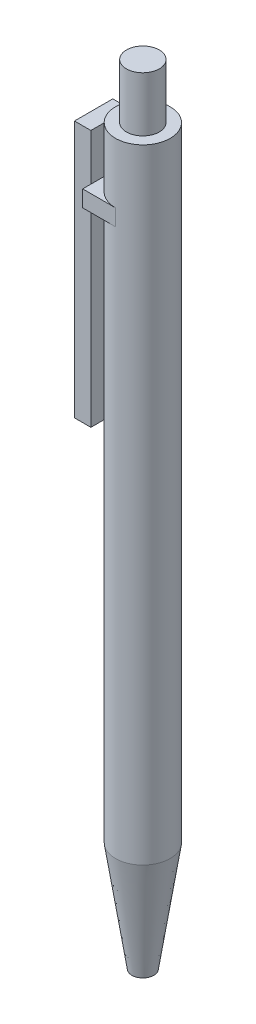
ISO-10303-21;
HEADER;
FILE_DESCRIPTION(('STEP AP214'),'2;1');
FILE_NAME('part.step','',(''),(''),'','','');
FILE_SCHEMA(('AUTOMOTIVE_DESIGN { 1 0 10303 214 1 1 1 1 }'));
ENDSEC;
DATA;
#1=APPLICATION_CONTEXT('core data for automotive mechanical design processes');
#2=APPLICATION_PROTOCOL_DEFINITION('international standard','automotive_design',2000,#1);
#3=PRODUCT_CONTEXT('',#1,'mechanical');
#4=PRODUCT('Part','Part','',(#3));
#5=PRODUCT_RELATED_PRODUCT_CATEGORY('part','',(#4));
#6=PRODUCT_DEFINITION_FORMATION('','',#4);
#7=PRODUCT_DEFINITION_CONTEXT('part definition',#1,'design');
#8=PRODUCT_DEFINITION('design','',#6,#7);
#9=PRODUCT_DEFINITION_SHAPE('','',#8);
#10=(LENGTH_UNIT() NAMED_UNIT(*) SI_UNIT(.MILLI.,.METRE.));
#11=(NAMED_UNIT(*) PLANE_ANGLE_UNIT() SI_UNIT($,.RADIAN.));
#12=(NAMED_UNIT(*) SI_UNIT($,.STERADIAN.) SOLID_ANGLE_UNIT());
#13=UNCERTAINTY_MEASURE_WITH_UNIT(LENGTH_MEASURE(1.E-05),#10,'distance_accuracy_value','');
#14=(GEOMETRIC_REPRESENTATION_CONTEXT(3) GLOBAL_UNCERTAINTY_ASSIGNED_CONTEXT((#13)) GLOBAL_UNIT_ASSIGNED_CONTEXT((#10,
#11,#12)) REPRESENTATION_CONTEXT('',''));
#15=CARTESIAN_POINT('',(0.,0.,0.));
#16=DIRECTION('',(0.,0.,1.));
#17=DIRECTION('',(1.,0.,0.));
#18=AXIS2_PLACEMENT_3D('',#15,#16,#17);
#19=CARTESIAN_POINT('',(0.,123.,0.));
#20=DIRECTION('',(0.,-1.,0.));
#21=DIRECTION('',(1.,0.,0.));
#22=AXIS2_PLACEMENT_3D('',#19,#20,#21);
#23=PLANE('',#22);
#24=CARTESIAN_POINT('',(0.,123.,0.));
#25=DIRECTION('',(0.,-1.,0.));
#26=DIRECTION('',(1.,0.,0.));
#27=AXIS2_PLACEMENT_3D('',#24,#25,#26);
#28=CIRCLE('',#27,5.);
#29=CARTESIAN_POINT('',(0.,123.,-5.));
#30=VERTEX_POINT('',#29);
#31=CARTESIAN_POINT('',(0.,123.,5.));
#32=VERTEX_POINT('',#31);
#33=EDGE_CURVE('E37',#30,#32,#28,.F.);
#34=ORIENTED_EDGE('',*,*,#33,.F.);
#35=DIRECTION('',(-1.,0.,0.));
#36=VECTOR('',#35,1.);
#37=CARTESIAN_POINT('',(-6.,123.,-5.));
#38=LINE('',#37,#36);
#39=CARTESIAN_POINT('',(-6.,123.,-5.));
#40=VERTEX_POINT('',#39);
#41=EDGE_CURVE('E112',#30,#40,#38,.T.);
#42=ORIENTED_EDGE('',*,*,#41,.T.);
#43=DIRECTION('',(0.,0.,1.));
#44=VECTOR('',#43,1.);
#45=CARTESIAN_POINT('',(-6.,123.,-5.));
#46=LINE('',#45,#44);
#47=CARTESIAN_POINT('',(-6.,123.,-3.5));
#48=VERTEX_POINT('',#47);
#49=EDGE_CURVE('E187',#40,#48,#46,.T.);
#50=ORIENTED_EDGE('',*,*,#49,.T.);
#51=CARTESIAN_POINT('',(-6.,123.,3.5));
#52=VERTEX_POINT('',#51);
#53=EDGE_CURVE('E189',#48,#52,#46,.T.);
#54=ORIENTED_EDGE('',*,*,#53,.T.);
#55=CARTESIAN_POINT('',(-6.,123.,5.));
#56=VERTEX_POINT('',#55);
#57=EDGE_CURVE('E49',#52,#56,#46,.T.);
#58=ORIENTED_EDGE('',*,*,#57,.T.);
#59=DIRECTION('',(1.,0.,0.));
#60=VECTOR('',#59,1.);
#61=CARTESIAN_POINT('',(-6.,123.,5.));
#62=LINE('',#61,#60);
#63=EDGE_CURVE('E121',#56,#32,#62,.T.);
#64=ORIENTED_EDGE('',*,*,#63,.T.);
#65=EDGE_LOOP('',(#34,#42,#50,#54,#58,#64));
#66=FACE_BOUND('',#65,.T.);
#67=ADVANCED_FACE('F33',(#66),#23,.F.);
#68=CARTESIAN_POINT('',(-6.,123.,-5.));
#69=DIRECTION('',(1.,0.,0.));
#70=DIRECTION('',(0.,1.,0.));
#71=AXIS2_PLACEMENT_3D('',#68,#69,#70);
#72=PLANE('',#71);
#73=DIRECTION('',(0.,1.,0.));
#74=VECTOR('',#73,1.);
#75=CARTESIAN_POINT('',(-6.,131.5,3.5));
#76=LINE('',#75,#74);
#77=CARTESIAN_POINT('',(-6.,120.,3.5));
#78=VERTEX_POINT('',#77);
#79=EDGE_CURVE('E133',#78,#52,#76,.T.);
#80=ORIENTED_EDGE('',*,*,#79,.F.);
#81=DIRECTION('',(0.,0.,1.));
#82=VECTOR('',#81,1.);
#83=CARTESIAN_POINT('',(-6.,120.,-5.));
#84=LINE('',#83,#82);
#85=CARTESIAN_POINT('',(-6.,120.,5.));
#86=VERTEX_POINT('',#85);
#87=EDGE_CURVE('E186',#78,#86,#84,.T.);
#88=ORIENTED_EDGE('',*,*,#87,.T.);
#89=DIRECTION('',(0.,-1.,0.));
#90=VECTOR('',#89,1.);
#91=CARTESIAN_POINT('',(-6.,123.,5.));
#92=LINE('',#91,#90);
#93=EDGE_CURVE('E201',#56,#86,#92,.T.);
#94=ORIENTED_EDGE('',*,*,#93,.F.);
#95=ORIENTED_EDGE('',*,*,#57,.F.);
#96=EDGE_LOOP('',(#80,#88,#94,#95));
#97=FACE_BOUND('',#96,.T.);
#98=ADVANCED_FACE('F221',(#97),#72,.F.);
#99=DIRECTION('',(0.,-1.,0.));
#100=VECTOR('',#99,1.);
#101=CARTESIAN_POINT('',(-6.,131.5,-3.5));
#102=LINE('',#101,#100);
#103=CARTESIAN_POINT('',(-6.,120.,-3.5));
#104=VERTEX_POINT('',#103);
#105=EDGE_CURVE('E57',#48,#104,#102,.T.);
#106=ORIENTED_EDGE('',*,*,#105,.F.);
#107=ORIENTED_EDGE('',*,*,#49,.F.);
#108=DIRECTION('',(0.,-1.,0.));
#109=VECTOR('',#108,1.);
#110=CARTESIAN_POINT('',(-6.,123.,-5.));
#111=LINE('',#110,#109);
#112=CARTESIAN_POINT('',(-6.,120.,-5.));
#113=VERTEX_POINT('',#112);
#114=EDGE_CURVE('E118',#40,#113,#111,.T.);
#115=ORIENTED_EDGE('',*,*,#114,.T.);
#116=EDGE_CURVE('E191',#113,#104,#84,.T.);
#117=ORIENTED_EDGE('',*,*,#116,.T.);
#118=EDGE_LOOP('',(#106,#107,#115,#117));
#119=FACE_BOUND('',#118,.T.);
#120=ADVANCED_FACE('F217',(#119),#72,.F.);
#121=CARTESIAN_POINT('',(0.,0.,0.));
#122=DIRECTION('',(0.,1.,0.));
#123=DIRECTION('',(-1.,0.,0.));
#124=AXIS2_PLACEMENT_3D('',#121,#122,#123);
#125=PLANE('',#124);
#126=CARTESIAN_POINT('',(0.,0.,0.));
#127=DIRECTION('',(0.,1.,0.));
#128=DIRECTION('',(-1.,0.,0.));
#129=AXIS2_PLACEMENT_3D('',#126,#127,#128);
#130=CIRCLE('',#129,2.);
#131=CARTESIAN_POINT('',(-2.,0.,0.));
#132=VERTEX_POINT('',#131);
#133=EDGE_CURVE('E205',#132,#132,#130,.T.);
#134=ORIENTED_EDGE('',*,*,#133,.F.);
#135=EDGE_LOOP('',(#134));
#136=FACE_BOUND('',#135,.T.);
#137=ADVANCED_FACE('F35',(#136),#125,.F.);
#138=CARTESIAN_POINT('',(0.,0.,0.));
#139=DIRECTION('',(0.,1.,0.));
#140=DIRECTION('',(-1.,0.,0.));
#141=AXIS2_PLACEMENT_3D('',#138,#139,#140);
#142=CONICAL_SURFACE('',#141,2.,0.148889947609497);
#143=CARTESIAN_POINT('',(0.,20.,0.));
#144=DIRECTION('',(0.,1.,0.));
#145=DIRECTION('',(-1.,0.,0.));
#146=AXIS2_PLACEMENT_3D('',#143,#144,#145);
#147=CIRCLE('',#146,5.);
#148=CARTESIAN_POINT('',(-5.,20.,0.));
#149=VERTEX_POINT('',#148);
#150=EDGE_CURVE('E140',#149,#149,#147,.T.);
#151=ORIENTED_EDGE('',*,*,#150,.F.);
#152=EDGE_LOOP('',(#151));
#153=FACE_BOUND('',#152,.T.);
#154=ORIENTED_EDGE('',*,*,#133,.T.);
#155=EDGE_LOOP('',(#154));
#156=FACE_BOUND('',#155,.T.);
#157=ADVANCED_FACE('F211',(#153,#156),#142,.T.);
#158=CARTESIAN_POINT('',(0.,120.,0.));
#159=DIRECTION('',(0.,-1.,0.));
#160=DIRECTION('',(1.,0.,0.));
#161=AXIS2_PLACEMENT_3D('',#158,#159,#160);
#162=CYLINDRICAL_SURFACE('',#161,5.);
#163=CARTESIAN_POINT('',(0.,120.,0.));
#164=DIRECTION('',(0.,1.,0.));
#165=DIRECTION('',(-1.,0.,0.));
#166=AXIS2_PLACEMENT_3D('',#163,#164,#165);
#167=CIRCLE('',#166,5.);
#168=CARTESIAN_POINT('',(0.,120.,-5.));
#169=VERTEX_POINT('',#168);
#170=CARTESIAN_POINT('',(0.,120.,5.));
#171=VERTEX_POINT('',#170);
#172=EDGE_CURVE('E128',#169,#171,#167,.T.);
#173=ORIENTED_EDGE('',*,*,#172,.F.);
#174=DIRECTION('',(0.,-1.,0.));
#175=VECTOR('',#174,1.);
#176=CARTESIAN_POINT('',(0.,123.,-5.));
#177=LINE('',#176,#175);
#178=EDGE_CURVE('E115',#30,#169,#177,.T.);
#179=ORIENTED_EDGE('',*,*,#178,.F.);
#180=ORIENTED_EDGE('',*,*,#33,.T.);
#181=DIRECTION('',(0.,-1.,0.));
#182=VECTOR('',#181,1.);
#183=CARTESIAN_POINT('',(0.,123.,5.));
#184=LINE('',#183,#182);
#185=EDGE_CURVE('E129',#32,#171,#184,.T.);
#186=ORIENTED_EDGE('',*,*,#185,.T.);
#187=EDGE_LOOP('',(#173,#179,#180,#186));
#188=FACE_BOUND('',#187,.T.);
#189=ORIENTED_EDGE('',*,*,#150,.T.);
#190=EDGE_LOOP('',(#189));
#191=FACE_BOUND('',#190,.T.);
#192=CARTESIAN_POINT('',(0.,134.,0.));
#193=DIRECTION('',(0.,1.,0.));
#194=DIRECTION('',(-1.,0.,0.));
#195=AXIS2_PLACEMENT_3D('',#192,#193,#194);
#196=CIRCLE('',#195,5.);
#197=CARTESIAN_POINT('',(-5.,134.,0.));
#198=VERTEX_POINT('',#197);
#199=EDGE_CURVE('E147',#198,#198,#196,.T.);
#200=ORIENTED_EDGE('',*,*,#199,.F.);
#201=EDGE_LOOP('',(#200));
#202=FACE_BOUND('',#201,.T.);
#203=ADVANCED_FACE('F125',(#188,#191,#202),#162,.T.);
#204=CARTESIAN_POINT('',(-6.,123.,5.));
#205=DIRECTION('',(0.,0.,-1.));
#206=DIRECTION('',(-1.,0.,0.));
#207=AXIS2_PLACEMENT_3D('',#204,#205,#206);
#208=PLANE('',#207);
#209=DIRECTION('',(1.,0.,0.));
#210=VECTOR('',#209,1.);
#211=CARTESIAN_POINT('',(-6.,120.,5.));
#212=LINE('',#211,#210);
#213=EDGE_CURVE('E193',#86,#171,#212,.T.);
#214=ORIENTED_EDGE('',*,*,#213,.T.);
#215=ORIENTED_EDGE('',*,*,#185,.F.);
#216=ORIENTED_EDGE('',*,*,#63,.F.);
#217=ORIENTED_EDGE('',*,*,#93,.T.);
#218=EDGE_LOOP('',(#214,#215,#216,#217));
#219=FACE_BOUND('',#218,.T.);
#220=ADVANCED_FACE('F239',(#219),#208,.F.);
#221=CARTESIAN_POINT('',(-6.,123.,-5.));
#222=DIRECTION('',(0.,0.,1.));
#223=DIRECTION('',(1.,0.,0.));
#224=AXIS2_PLACEMENT_3D('',#221,#222,#223);
#225=PLANE('',#224);
#226=DIRECTION('',(-1.,0.,0.));
#227=VECTOR('',#226,1.);
#228=CARTESIAN_POINT('',(-6.,120.,-5.));
#229=LINE('',#228,#227);
#230=EDGE_CURVE('E197',#169,#113,#229,.T.);
#231=ORIENTED_EDGE('',*,*,#230,.T.);
#232=ORIENTED_EDGE('',*,*,#114,.F.);
#233=ORIENTED_EDGE('',*,*,#41,.F.);
#234=ORIENTED_EDGE('',*,*,#178,.T.);
#235=EDGE_LOOP('',(#231,#232,#233,#234));
#236=FACE_BOUND('',#235,.T.);
#237=ADVANCED_FACE('F114',(#236),#225,.F.);
#238=CARTESIAN_POINT('',(0.,120.,0.));
#239=DIRECTION('',(0.,-1.,0.));
#240=DIRECTION('',(1.,0.,0.));
#241=AXIS2_PLACEMENT_3D('',#238,#239,#240);
#242=PLANE('',#241);
#243=ORIENTED_EDGE('',*,*,#230,.F.);
#244=ORIENTED_EDGE('',*,*,#172,.T.);
#245=ORIENTED_EDGE('',*,*,#213,.F.);
#246=ORIENTED_EDGE('',*,*,#87,.F.);
#247=EDGE_CURVE('E194',#104,#78,#84,.T.);
#248=ORIENTED_EDGE('',*,*,#247,.F.);
#249=ORIENTED_EDGE('',*,*,#116,.F.);
#250=EDGE_LOOP('',(#243,#244,#245,#246,#248,#249));
#251=FACE_BOUND('',#250,.T.);
#252=ADVANCED_FACE('F232',(#251),#242,.T.);
#253=CARTESIAN_POINT('',(-6.,0.,0.));
#254=DIRECTION('',(-1.,0.,0.));
#255=DIRECTION('',(0.,-1.,0.));
#256=AXIS2_PLACEMENT_3D('',#253,#254,#255);
#257=PLANE('',#256);
#258=CARTESIAN_POINT('',(-6.,84.5,-3.49999999999999));
#259=VERTEX_POINT('',#258);
#260=EDGE_CURVE('E143',#104,#259,#102,.T.);
#261=ORIENTED_EDGE('',*,*,#260,.F.);
#262=ORIENTED_EDGE('',*,*,#247,.T.);
#263=CARTESIAN_POINT('',(-6.,84.5,3.50000000000001));
#264=VERTEX_POINT('',#263);
#265=EDGE_CURVE('E136',#264,#78,#76,.T.);
#266=ORIENTED_EDGE('',*,*,#265,.F.);
#267=DIRECTION('',(0.,0.,1.));
#268=VECTOR('',#267,1.);
#269=CARTESIAN_POINT('',(-6.,84.5,-3.49999999999999));
#270=LINE('',#269,#268);
#271=EDGE_CURVE('E163',#259,#264,#270,.T.);
#272=ORIENTED_EDGE('',*,*,#271,.F.);
#273=EDGE_LOOP('',(#261,#262,#266,#272));
#274=FACE_BOUND('',#273,.T.);
#275=ADVANCED_FACE('F235',(#274),#257,.F.);
#276=CARTESIAN_POINT('',(-9.,131.5,3.5));
#277=DIRECTION('',(0.,0.,-1.));
#278=DIRECTION('',(0.,1.,0.));
#279=AXIS2_PLACEMENT_3D('',#276,#277,#278);
#280=PLANE('',#279);
#281=ORIENTED_EDGE('',*,*,#265,.T.);
#282=ORIENTED_EDGE('',*,*,#79,.T.);
#283=CARTESIAN_POINT('',(-6.,131.5,3.5));
#284=VERTEX_POINT('',#283);
#285=EDGE_CURVE('E137',#52,#284,#76,.T.);
#286=ORIENTED_EDGE('',*,*,#285,.T.);
#287=DIRECTION('',(1.,0.,0.));
#288=VECTOR('',#287,1.);
#289=CARTESIAN_POINT('',(-9.,131.5,3.5));
#290=LINE('',#289,#288);
#291=CARTESIAN_POINT('',(-9.,131.5,3.5));
#292=VERTEX_POINT('',#291);
#293=EDGE_CURVE('E183',#292,#284,#290,.T.);
#294=ORIENTED_EDGE('',*,*,#293,.F.);
#295=DIRECTION('',(0.,1.,0.));
#296=VECTOR('',#295,1.);
#297=CARTESIAN_POINT('',(-9.,131.5,3.5));
#298=LINE('',#297,#296);
#299=CARTESIAN_POINT('',(-9.,84.5,3.50000000000001));
#300=VERTEX_POINT('',#299);
#301=EDGE_CURVE('E159',#300,#292,#298,.T.);
#302=ORIENTED_EDGE('',*,*,#301,.F.);
#303=DIRECTION('',(1.,0.,0.));
#304=VECTOR('',#303,1.);
#305=CARTESIAN_POINT('',(-9.,84.5,3.50000000000001));
#306=LINE('',#305,#304);
#307=EDGE_CURVE('E167',#300,#264,#306,.T.);
#308=ORIENTED_EDGE('',*,*,#307,.T.);
#309=EDGE_LOOP('',(#281,#282,#286,#294,#302,#308));
#310=FACE_BOUND('',#309,.T.);
#311=ADVANCED_FACE('F230',(#310),#280,.F.);
#312=CARTESIAN_POINT('',(-9.,131.5,-3.5));
#313=DIRECTION('',(0.,-1.,0.));
#314=DIRECTION('',(1.,0.,0.));
#315=AXIS2_PLACEMENT_3D('',#312,#313,#314);
#316=PLANE('',#315);
#317=DIRECTION('',(0.,0.,-1.));
#318=VECTOR('',#317,1.);
#319=CARTESIAN_POINT('',(-6.,131.5,-3.5));
#320=LINE('',#319,#318);
#321=CARTESIAN_POINT('',(-6.,131.5,-3.5));
#322=VERTEX_POINT('',#321);
#323=EDGE_CURVE('E146',#284,#322,#320,.T.);
#324=ORIENTED_EDGE('',*,*,#323,.T.);
#325=DIRECTION('',(1.,0.,0.));
#326=VECTOR('',#325,1.);
#327=CARTESIAN_POINT('',(-9.,131.5,-3.5));
#328=LINE('',#327,#326);
#329=CARTESIAN_POINT('',(-9.,131.5,-3.5));
#330=VERTEX_POINT('',#329);
#331=EDGE_CURVE('E177',#330,#322,#328,.T.);
#332=ORIENTED_EDGE('',*,*,#331,.F.);
#333=DIRECTION('',(0.,0.,-1.));
#334=VECTOR('',#333,1.);
#335=CARTESIAN_POINT('',(-9.,131.5,-3.5));
#336=LINE('',#335,#334);
#337=EDGE_CURVE('E162',#292,#330,#336,.T.);
#338=ORIENTED_EDGE('',*,*,#337,.F.);
#339=ORIENTED_EDGE('',*,*,#293,.T.);
#340=EDGE_LOOP('',(#324,#332,#338,#339));
#341=FACE_BOUND('',#340,.T.);
#342=ADVANCED_FACE('F277',(#341),#316,.F.);
#343=CARTESIAN_POINT('',(-9.,131.5,-3.5));
#344=DIRECTION('',(0.,0.,1.));
#345=DIRECTION('',(0.,-1.,0.));
#346=AXIS2_PLACEMENT_3D('',#343,#344,#345);
#347=PLANE('',#346);
#348=EDGE_CURVE('E142',#322,#48,#102,.T.);
#349=ORIENTED_EDGE('',*,*,#348,.T.);
#350=ORIENTED_EDGE('',*,*,#105,.T.);
#351=ORIENTED_EDGE('',*,*,#260,.T.);
#352=DIRECTION('',(1.,0.,0.));
#353=VECTOR('',#352,1.);
#354=CARTESIAN_POINT('',(-9.,84.5,-3.49999999999999));
#355=LINE('',#354,#353);
#356=CARTESIAN_POINT('',(-9.,84.5,-3.49999999999999));
#357=VERTEX_POINT('',#356);
#358=EDGE_CURVE('E172',#357,#259,#355,.T.);
#359=ORIENTED_EDGE('',*,*,#358,.F.);
#360=DIRECTION('',(0.,-1.,0.));
#361=VECTOR('',#360,1.);
#362=CARTESIAN_POINT('',(-9.,131.5,-3.5));
#363=LINE('',#362,#361);
#364=EDGE_CURVE('E165',#330,#357,#363,.T.);
#365=ORIENTED_EDGE('',*,*,#364,.F.);
#366=ORIENTED_EDGE('',*,*,#331,.T.);
#367=EDGE_LOOP('',(#349,#350,#351,#359,#365,#366));
#368=FACE_BOUND('',#367,.T.);
#369=ADVANCED_FACE('F283',(#368),#347,.F.);
#370=CARTESIAN_POINT('',(-9.,84.5,-3.49999999999999));
#371=DIRECTION('',(0.,1.,0.));
#372=DIRECTION('',(-1.,0.,0.));
#373=AXIS2_PLACEMENT_3D('',#370,#371,#372);
#374=PLANE('',#373);
#375=ORIENTED_EDGE('',*,*,#271,.T.);
#376=ORIENTED_EDGE('',*,*,#307,.F.);
#377=DIRECTION('',(0.,0.,1.));
#378=VECTOR('',#377,1.);
#379=CARTESIAN_POINT('',(-9.,84.5,-3.49999999999999));
#380=LINE('',#379,#378);
#381=EDGE_CURVE('E166',#357,#300,#380,.T.);
#382=ORIENTED_EDGE('',*,*,#381,.F.);
#383=ORIENTED_EDGE('',*,*,#358,.T.);
#384=EDGE_LOOP('',(#375,#376,#382,#383));
#385=FACE_BOUND('',#384,.T.);
#386=ADVANCED_FACE('F290',(#385),#374,.F.);
#387=CARTESIAN_POINT('',(-9.,0.,0.));
#388=DIRECTION('',(-1.,0.,0.));
#389=DIRECTION('',(0.,-1.,0.));
#390=AXIS2_PLACEMENT_3D('',#387,#388,#389);
#391=PLANE('',#390);
#392=ORIENTED_EDGE('',*,*,#301,.T.);
#393=ORIENTED_EDGE('',*,*,#337,.T.);
#394=ORIENTED_EDGE('',*,*,#364,.T.);
#395=ORIENTED_EDGE('',*,*,#381,.T.);
#396=EDGE_LOOP('',(#392,#393,#394,#395));
#397=FACE_BOUND('',#396,.T.);
#398=ADVANCED_FACE('F298',(#397),#391,.T.);
#399=ORIENTED_EDGE('',*,*,#53,.F.);
#400=ORIENTED_EDGE('',*,*,#348,.F.);
#401=ORIENTED_EDGE('',*,*,#323,.F.);
#402=ORIENTED_EDGE('',*,*,#285,.F.);
#403=EDGE_LOOP('',(#399,#400,#401,#402));
#404=FACE_BOUND('',#403,.T.);
#405=ADVANCED_FACE('F271',(#404),#257,.F.);
#406=CARTESIAN_POINT('',(0.,134.,0.));
#407=DIRECTION('',(0.,1.,0.));
#408=DIRECTION('',(-1.,0.,0.));
#409=AXIS2_PLACEMENT_3D('',#406,#407,#408);
#410=PLANE('',#409);
#411=CARTESIAN_POINT('',(0.,134.,0.));
#412=DIRECTION('',(0.,1.,0.));
#413=DIRECTION('',(-1.,0.,0.));
#414=AXIS2_PLACEMENT_3D('',#411,#412,#413);
#415=CIRCLE('',#414,3.);
#416=CARTESIAN_POINT('',(-3.,134.,0.));
#417=VERTEX_POINT('',#416);
#418=EDGE_CURVE('E11',#417,#417,#415,.T.);
#419=ORIENTED_EDGE('',*,*,#418,.F.);
#420=EDGE_LOOP('',(#419));
#421=FACE_BOUND('',#420,.T.);
#422=ORIENTED_EDGE('',*,*,#199,.T.);
#423=EDGE_LOOP('',(#422));
#424=FACE_BOUND('',#423,.T.);
#425=ADVANCED_FACE('F312',(#421,#424),#410,.T.);
#426=CARTESIAN_POINT('',(0.,144.,0.));
#427=DIRECTION('',(0.,-1.,0.));
#428=DIRECTION('',(1.,0.,0.));
#429=AXIS2_PLACEMENT_3D('',#426,#427,#428);
#430=CYLINDRICAL_SURFACE('',#429,3.);
#431=CARTESIAN_POINT('',(0.,144.,0.));
#432=DIRECTION('',(0.,1.,0.));
#433=DIRECTION('',(-1.,0.,0.));
#434=AXIS2_PLACEMENT_3D('',#431,#432,#433);
#435=CIRCLE('',#434,3.);
#436=CARTESIAN_POINT('',(-3.,144.,0.));
#437=VERTEX_POINT('',#436);
#438=EDGE_CURVE('E152',#437,#437,#435,.T.);
#439=ORIENTED_EDGE('',*,*,#438,.F.);
#440=EDGE_LOOP('',(#439));
#441=FACE_BOUND('',#440,.T.);
#442=ORIENTED_EDGE('',*,*,#418,.T.);
#443=EDGE_LOOP('',(#442));
#444=FACE_BOUND('',#443,.T.);
#445=ADVANCED_FACE('F318',(#441,#444),#430,.T.);
#446=CARTESIAN_POINT('',(0.,144.,0.));
#447=DIRECTION('',(0.,1.,0.));
#448=DIRECTION('',(-1.,0.,0.));
#449=AXIS2_PLACEMENT_3D('',#446,#447,#448);
#450=PLANE('',#449);
#451=ORIENTED_EDGE('',*,*,#438,.T.);
#452=EDGE_LOOP('',(#451));
#453=FACE_BOUND('',#452,.T.);
#454=ADVANCED_FACE('F326',(#453),#450,.T.);
#455=CLOSED_SHELL('',(#67,#98,#120,#137,#157,#203,#220,#237,#252,#275,#311,#342,#369,#386,#398,
#405,#425,#445,#454));
#456=MANIFOLD_SOLID_BREP('B2',#455);
#457=ADVANCED_BREP_SHAPE_REPRESENTATION('',(#18,#456),#14);
#458=SHAPE_DEFINITION_REPRESENTATION(#9,#457);
ENDSEC;
END-ISO-10303-21;
